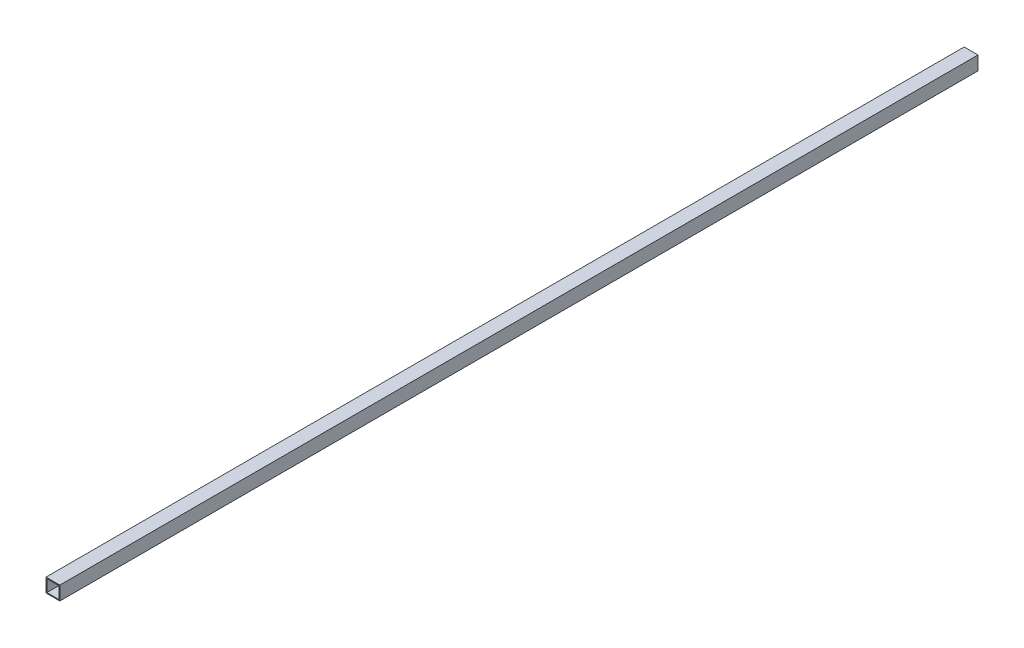
ISO-10303-21;
HEADER;
FILE_DESCRIPTION(('STEP AP214'),'2;1');
FILE_NAME('part.step','',(''),(''),'','','');
FILE_SCHEMA(('AUTOMOTIVE_DESIGN { 1 0 10303 214 1 1 1 1 }'));
ENDSEC;
DATA;
#1=APPLICATION_CONTEXT('core data for automotive mechanical design processes');
#2=APPLICATION_PROTOCOL_DEFINITION('international standard','automotive_design',2000,#1);
#3=PRODUCT_CONTEXT('',#1,'mechanical');
#4=PRODUCT('Part','Part','',(#3));
#5=PRODUCT_RELATED_PRODUCT_CATEGORY('part','',(#4));
#6=PRODUCT_DEFINITION_FORMATION('','',#4);
#7=PRODUCT_DEFINITION_CONTEXT('part definition',#1,'design');
#8=PRODUCT_DEFINITION('design','',#6,#7);
#9=PRODUCT_DEFINITION_SHAPE('','',#8);
#10=(LENGTH_UNIT() NAMED_UNIT(*) SI_UNIT(.MILLI.,.METRE.));
#11=(NAMED_UNIT(*) PLANE_ANGLE_UNIT() SI_UNIT($,.RADIAN.));
#12=(NAMED_UNIT(*) SI_UNIT($,.STERADIAN.) SOLID_ANGLE_UNIT());
#13=UNCERTAINTY_MEASURE_WITH_UNIT(LENGTH_MEASURE(1.E-05),#10,'distance_accuracy_value','');
#14=(GEOMETRIC_REPRESENTATION_CONTEXT(3) GLOBAL_UNCERTAINTY_ASSIGNED_CONTEXT((#13)) GLOBAL_UNIT_ASSIGNED_CONTEXT((#10,
#11,#12)) REPRESENTATION_CONTEXT('',''));
#15=CARTESIAN_POINT('',(0.,0.,0.));
#16=DIRECTION('',(0.,0.,1.));
#17=DIRECTION('',(1.,0.,0.));
#18=AXIS2_PLACEMENT_3D('',#15,#16,#17);
#19=CARTESIAN_POINT('',(0.,0.,996.));
#20=DIRECTION('',(0.,0.,-1.));
#21=DIRECTION('',(-1.,0.,0.));
#22=AXIS2_PLACEMENT_3D('',#19,#20,#21);
#23=PLANE('',#22);
#24=DIRECTION('',(0.,1.,0.));
#25=VECTOR('',#24,1.);
#26=CARTESIAN_POINT('',(15.,-15.,996.));
#27=LINE('',#26,#25);
#28=CARTESIAN_POINT('',(15.,-15.,996.));
#29=VERTEX_POINT('',#28);
#30=CARTESIAN_POINT('',(15.,15.,996.));
#31=VERTEX_POINT('',#30);
#32=EDGE_CURVE('E133',#29,#31,#27,.T.);
#33=ORIENTED_EDGE('',*,*,#32,.T.);
#34=DIRECTION('',(-1.,0.,0.));
#35=VECTOR('',#34,1.);
#36=CARTESIAN_POINT('',(-15.,15.,996.));
#37=LINE('',#36,#35);
#38=CARTESIAN_POINT('',(-15.,15.,996.));
#39=VERTEX_POINT('',#38);
#40=EDGE_CURVE('E136',#31,#39,#37,.T.);
#41=ORIENTED_EDGE('',*,*,#40,.T.);
#42=DIRECTION('',(0.,-1.,0.));
#43=VECTOR('',#42,1.);
#44=CARTESIAN_POINT('',(-15.,-15.,996.));
#45=LINE('',#44,#43);
#46=CARTESIAN_POINT('',(-15.,-15.,996.));
#47=VERTEX_POINT('',#46);
#48=EDGE_CURVE('E139',#39,#47,#45,.T.);
#49=ORIENTED_EDGE('',*,*,#48,.T.);
#50=DIRECTION('',(1.,0.,0.));
#51=VECTOR('',#50,1.);
#52=CARTESIAN_POINT('',(-15.,-15.,996.));
#53=LINE('',#52,#51);
#54=EDGE_CURVE('E141',#47,#29,#53,.T.);
#55=ORIENTED_EDGE('',*,*,#54,.T.);
#56=EDGE_LOOP('',(#33,#41,#49,#55));
#57=FACE_BOUND('',#56,.T.);
#58=DIRECTION('',(1.,0.,0.));
#59=VECTOR('',#58,1.);
#60=CARTESIAN_POINT('',(-13.,-13.,996.));
#61=LINE('',#60,#59);
#62=CARTESIAN_POINT('',(-13.,-13.,996.));
#63=VERTEX_POINT('',#62);
#64=CARTESIAN_POINT('',(13.,-13.,996.));
#65=VERTEX_POINT('',#64);
#66=EDGE_CURVE('E97',#63,#65,#61,.T.);
#67=ORIENTED_EDGE('',*,*,#66,.F.);
#68=DIRECTION('',(0.,-1.,0.));
#69=VECTOR('',#68,1.);
#70=CARTESIAN_POINT('',(-13.,-13.,996.));
#71=LINE('',#70,#69);
#72=CARTESIAN_POINT('',(-13.,13.,996.));
#73=VERTEX_POINT('',#72);
#74=EDGE_CURVE('E119',#73,#63,#71,.T.);
#75=ORIENTED_EDGE('',*,*,#74,.F.);
#76=DIRECTION('',(-1.,0.,0.));
#77=VECTOR('',#76,1.);
#78=CARTESIAN_POINT('',(-13.,13.,996.));
#79=LINE('',#78,#77);
#80=CARTESIAN_POINT('',(13.,13.,996.));
#81=VERTEX_POINT('',#80);
#82=EDGE_CURVE('E117',#81,#73,#79,.T.);
#83=ORIENTED_EDGE('',*,*,#82,.F.);
#84=DIRECTION('',(0.,1.,0.));
#85=VECTOR('',#84,1.);
#86=CARTESIAN_POINT('',(13.,-13.,996.));
#87=LINE('',#86,#85);
#88=EDGE_CURVE('E105',#65,#81,#87,.T.);
#89=ORIENTED_EDGE('',*,*,#88,.F.);
#90=EDGE_LOOP('',(#67,#75,#83,#89));
#91=FACE_BOUND('',#90,.T.);
#92=ADVANCED_FACE('F32',(#57,#91),#23,.F.);
#93=CARTESIAN_POINT('',(0.,0.,-996.));
#94=DIRECTION('',(0.,0.,-1.));
#95=DIRECTION('',(-1.,0.,0.));
#96=AXIS2_PLACEMENT_3D('',#93,#94,#95);
#97=PLANE('',#96);
#98=DIRECTION('',(0.,1.,0.));
#99=VECTOR('',#98,1.);
#100=CARTESIAN_POINT('',(15.,-15.,-996.));
#101=LINE('',#100,#99);
#102=CARTESIAN_POINT('',(15.,-15.,-996.));
#103=VERTEX_POINT('',#102);
#104=CARTESIAN_POINT('',(15.,15.,-996.));
#105=VERTEX_POINT('',#104);
#106=EDGE_CURVE('E113',#103,#105,#101,.T.);
#107=ORIENTED_EDGE('',*,*,#106,.F.);
#108=DIRECTION('',(1.,0.,0.));
#109=VECTOR('',#108,1.);
#110=CARTESIAN_POINT('',(-15.,-15.,-996.));
#111=LINE('',#110,#109);
#112=CARTESIAN_POINT('',(-15.,-15.,-996.));
#113=VERTEX_POINT('',#112);
#114=EDGE_CURVE('E137',#113,#103,#111,.T.);
#115=ORIENTED_EDGE('',*,*,#114,.F.);
#116=DIRECTION('',(0.,-1.,0.));
#117=VECTOR('',#116,1.);
#118=CARTESIAN_POINT('',(-15.,-15.,-996.));
#119=LINE('',#118,#117);
#120=CARTESIAN_POINT('',(-15.,15.,-996.));
#121=VERTEX_POINT('',#120);
#122=EDGE_CURVE('E148',#121,#113,#119,.T.);
#123=ORIENTED_EDGE('',*,*,#122,.F.);
#124=DIRECTION('',(-1.,0.,0.));
#125=VECTOR('',#124,1.);
#126=CARTESIAN_POINT('',(-15.,15.,-996.));
#127=LINE('',#126,#125);
#128=EDGE_CURVE('E146',#105,#121,#127,.T.);
#129=ORIENTED_EDGE('',*,*,#128,.F.);
#130=EDGE_LOOP('',(#107,#115,#123,#129));
#131=FACE_BOUND('',#130,.T.);
#132=DIRECTION('',(0.,-1.,0.));
#133=VECTOR('',#132,1.);
#134=CARTESIAN_POINT('',(-13.,-13.,-996.));
#135=LINE('',#134,#133);
#136=CARTESIAN_POINT('',(-13.,13.,-996.));
#137=VERTEX_POINT('',#136);
#138=CARTESIAN_POINT('',(-13.,-13.,-996.));
#139=VERTEX_POINT('',#138);
#140=EDGE_CURVE('E106',#137,#139,#135,.T.);
#141=ORIENTED_EDGE('',*,*,#140,.T.);
#142=DIRECTION('',(1.,0.,0.));
#143=VECTOR('',#142,1.);
#144=CARTESIAN_POINT('',(-13.,-13.,-996.));
#145=LINE('',#144,#143);
#146=CARTESIAN_POINT('',(13.,-13.,-996.));
#147=VERTEX_POINT('',#146);
#148=EDGE_CURVE('E55',#139,#147,#145,.T.);
#149=ORIENTED_EDGE('',*,*,#148,.T.);
#150=DIRECTION('',(0.,1.,0.));
#151=VECTOR('',#150,1.);
#152=CARTESIAN_POINT('',(13.,-13.,-996.));
#153=LINE('',#152,#151);
#154=CARTESIAN_POINT('',(13.,13.,-996.));
#155=VERTEX_POINT('',#154);
#156=EDGE_CURVE('E112',#147,#155,#153,.T.);
#157=ORIENTED_EDGE('',*,*,#156,.T.);
#158=DIRECTION('',(-1.,0.,0.));
#159=VECTOR('',#158,1.);
#160=CARTESIAN_POINT('',(-13.,13.,-996.));
#161=LINE('',#160,#159);
#162=EDGE_CURVE('E125',#155,#137,#161,.T.);
#163=ORIENTED_EDGE('',*,*,#162,.T.);
#164=EDGE_LOOP('',(#141,#149,#157,#163));
#165=FACE_BOUND('',#164,.T.);
#166=ADVANCED_FACE('F166',(#131,#165),#97,.T.);
#167=CARTESIAN_POINT('',(15.,-15.,996.));
#168=DIRECTION('',(-1.,0.,0.));
#169=DIRECTION('',(0.,0.,1.));
#170=AXIS2_PLACEMENT_3D('',#167,#168,#169);
#171=PLANE('',#170);
#172=ORIENTED_EDGE('',*,*,#106,.T.);
#173=DIRECTION('',(0.,0.,-1.));
#174=VECTOR('',#173,1.);
#175=CARTESIAN_POINT('',(15.,15.,996.));
#176=LINE('',#175,#174);
#177=EDGE_CURVE('E11',#31,#105,#176,.T.);
#178=ORIENTED_EDGE('',*,*,#177,.F.);
#179=ORIENTED_EDGE('',*,*,#32,.F.);
#180=DIRECTION('',(0.,0.,-1.));
#181=VECTOR('',#180,1.);
#182=CARTESIAN_POINT('',(15.,-15.,996.));
#183=LINE('',#182,#181);
#184=EDGE_CURVE('E143',#29,#103,#183,.T.);
#185=ORIENTED_EDGE('',*,*,#184,.T.);
#186=EDGE_LOOP('',(#172,#178,#179,#185));
#187=FACE_BOUND('',#186,.T.);
#188=ADVANCED_FACE('F34',(#187),#171,.F.);
#189=CARTESIAN_POINT('',(-15.,15.,996.));
#190=DIRECTION('',(0.,-1.,0.));
#191=DIRECTION('',(0.,0.,-1.));
#192=AXIS2_PLACEMENT_3D('',#189,#190,#191);
#193=PLANE('',#192);
#194=ORIENTED_EDGE('',*,*,#128,.T.);
#195=DIRECTION('',(0.,0.,-1.));
#196=VECTOR('',#195,1.);
#197=CARTESIAN_POINT('',(-15.,15.,996.));
#198=LINE('',#197,#196);
#199=EDGE_CURVE('E40',#39,#121,#198,.T.);
#200=ORIENTED_EDGE('',*,*,#199,.F.);
#201=ORIENTED_EDGE('',*,*,#40,.F.);
#202=ORIENTED_EDGE('',*,*,#177,.T.);
#203=EDGE_LOOP('',(#194,#200,#201,#202));
#204=FACE_BOUND('',#203,.T.);
#205=ADVANCED_FACE('F176',(#204),#193,.F.);
#206=CARTESIAN_POINT('',(-15.,-15.,996.));
#207=DIRECTION('',(1.,0.,0.));
#208=DIRECTION('',(0.,0.,-1.));
#209=AXIS2_PLACEMENT_3D('',#206,#207,#208);
#210=PLANE('',#209);
#211=ORIENTED_EDGE('',*,*,#122,.T.);
#212=DIRECTION('',(0.,0.,-1.));
#213=VECTOR('',#212,1.);
#214=CARTESIAN_POINT('',(-15.,-15.,996.));
#215=LINE('',#214,#213);
#216=EDGE_CURVE('E153',#47,#113,#215,.T.);
#217=ORIENTED_EDGE('',*,*,#216,.F.);
#218=ORIENTED_EDGE('',*,*,#48,.F.);
#219=ORIENTED_EDGE('',*,*,#199,.T.);
#220=EDGE_LOOP('',(#211,#217,#218,#219));
#221=FACE_BOUND('',#220,.T.);
#222=ADVANCED_FACE('F160',(#221),#210,.F.);
#223=CARTESIAN_POINT('',(-15.,-15.,996.));
#224=DIRECTION('',(0.,1.,0.));
#225=DIRECTION('',(0.,0.,1.));
#226=AXIS2_PLACEMENT_3D('',#223,#224,#225);
#227=PLANE('',#226);
#228=ORIENTED_EDGE('',*,*,#114,.T.);
#229=ORIENTED_EDGE('',*,*,#184,.F.);
#230=ORIENTED_EDGE('',*,*,#54,.F.);
#231=ORIENTED_EDGE('',*,*,#216,.T.);
#232=EDGE_LOOP('',(#228,#229,#230,#231));
#233=FACE_BOUND('',#232,.T.);
#234=ADVANCED_FACE('F170',(#233),#227,.F.);
#235=CARTESIAN_POINT('',(-13.,-13.,996.));
#236=DIRECTION('',(0.,1.,0.));
#237=DIRECTION('',(0.,0.,1.));
#238=AXIS2_PLACEMENT_3D('',#235,#236,#237);
#239=PLANE('',#238);
#240=ORIENTED_EDGE('',*,*,#148,.F.);
#241=DIRECTION('',(0.,0.,-1.));
#242=VECTOR('',#241,1.);
#243=CARTESIAN_POINT('',(-13.,-13.,996.));
#244=LINE('',#243,#242);
#245=EDGE_CURVE('E101',#63,#139,#244,.T.);
#246=ORIENTED_EDGE('',*,*,#245,.F.);
#247=ORIENTED_EDGE('',*,*,#66,.T.);
#248=DIRECTION('',(0.,0.,-1.));
#249=VECTOR('',#248,1.);
#250=CARTESIAN_POINT('',(13.,-13.,996.));
#251=LINE('',#250,#249);
#252=EDGE_CURVE('E100',#65,#147,#251,.T.);
#253=ORIENTED_EDGE('',*,*,#252,.T.);
#254=EDGE_LOOP('',(#240,#246,#247,#253));
#255=FACE_BOUND('',#254,.T.);
#256=ADVANCED_FACE('F99',(#255),#239,.T.);
#257=CARTESIAN_POINT('',(13.,-13.,996.));
#258=DIRECTION('',(-1.,0.,0.));
#259=DIRECTION('',(0.,-1.,0.));
#260=AXIS2_PLACEMENT_3D('',#257,#258,#259);
#261=PLANE('',#260);
#262=ORIENTED_EDGE('',*,*,#156,.F.);
#263=ORIENTED_EDGE('',*,*,#252,.F.);
#264=ORIENTED_EDGE('',*,*,#88,.T.);
#265=DIRECTION('',(0.,0.,-1.));
#266=VECTOR('',#265,1.);
#267=CARTESIAN_POINT('',(13.,13.,996.));
#268=LINE('',#267,#266);
#269=EDGE_CURVE('E114',#81,#155,#268,.T.);
#270=ORIENTED_EDGE('',*,*,#269,.T.);
#271=EDGE_LOOP('',(#262,#263,#264,#270));
#272=FACE_BOUND('',#271,.T.);
#273=ADVANCED_FACE('F109',(#272),#261,.T.);
#274=CARTESIAN_POINT('',(-13.,13.,996.));
#275=DIRECTION('',(0.,-1.,0.));
#276=DIRECTION('',(1.,0.,0.));
#277=AXIS2_PLACEMENT_3D('',#274,#275,#276);
#278=PLANE('',#277);
#279=ORIENTED_EDGE('',*,*,#162,.F.);
#280=ORIENTED_EDGE('',*,*,#269,.F.);
#281=ORIENTED_EDGE('',*,*,#82,.T.);
#282=DIRECTION('',(0.,0.,-1.));
#283=VECTOR('',#282,1.);
#284=CARTESIAN_POINT('',(-13.,13.,996.));
#285=LINE('',#284,#283);
#286=EDGE_CURVE('E47',#73,#137,#285,.T.);
#287=ORIENTED_EDGE('',*,*,#286,.T.);
#288=EDGE_LOOP('',(#279,#280,#281,#287));
#289=FACE_BOUND('',#288,.T.);
#290=ADVANCED_FACE('F199',(#289),#278,.T.);
#291=CARTESIAN_POINT('',(-13.,-13.,996.));
#292=DIRECTION('',(1.,0.,0.));
#293=DIRECTION('',(0.,0.,-1.));
#294=AXIS2_PLACEMENT_3D('',#291,#292,#293);
#295=PLANE('',#294);
#296=ORIENTED_EDGE('',*,*,#140,.F.);
#297=ORIENTED_EDGE('',*,*,#286,.F.);
#298=ORIENTED_EDGE('',*,*,#74,.T.);
#299=ORIENTED_EDGE('',*,*,#245,.T.);
#300=EDGE_LOOP('',(#296,#297,#298,#299));
#301=FACE_BOUND('',#300,.T.);
#302=ADVANCED_FACE('F203',(#301),#295,.T.);
#303=CLOSED_SHELL('',(#92,#166,#188,#205,#222,#234,#256,#273,#290,#302));
#304=MANIFOLD_SOLID_BREP('B2',#303);
#305=ADVANCED_BREP_SHAPE_REPRESENTATION('',(#18,#304),#14);
#306=SHAPE_DEFINITION_REPRESENTATION(#9,#305);
ENDSEC;
END-ISO-10303-21;
